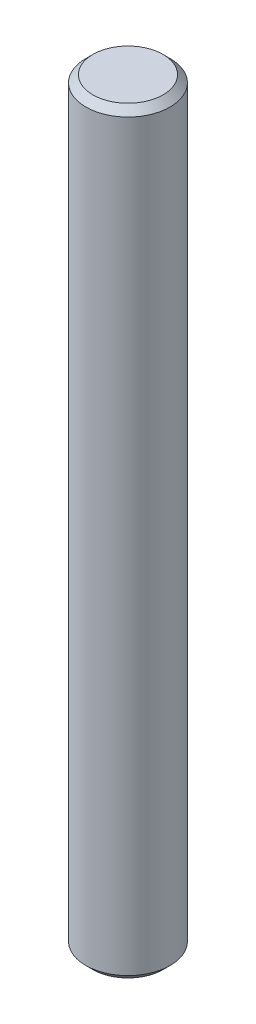
ISO-10303-21;
HEADER;
FILE_DESCRIPTION(('STEP AP214'),'2;1');
FILE_NAME('part.step','',(''),(''),'','','');
FILE_SCHEMA(('AUTOMOTIVE_DESIGN { 1 0 10303 214 1 1 1 1 }'));
ENDSEC;
DATA;
#1=APPLICATION_CONTEXT('core data for automotive mechanical design processes');
#2=APPLICATION_PROTOCOL_DEFINITION('international standard','automotive_design',2000,#1);
#3=PRODUCT_CONTEXT('',#1,'mechanical');
#4=PRODUCT('Part','Part','',(#3));
#5=PRODUCT_RELATED_PRODUCT_CATEGORY('part','',(#4));
#6=PRODUCT_DEFINITION_FORMATION('','',#4);
#7=PRODUCT_DEFINITION_CONTEXT('part definition',#1,'design');
#8=PRODUCT_DEFINITION('design','',#6,#7);
#9=PRODUCT_DEFINITION_SHAPE('','',#8);
#10=(LENGTH_UNIT() NAMED_UNIT(*) SI_UNIT(.MILLI.,.METRE.));
#11=(NAMED_UNIT(*) PLANE_ANGLE_UNIT() SI_UNIT($,.RADIAN.));
#12=(NAMED_UNIT(*) SI_UNIT($,.STERADIAN.) SOLID_ANGLE_UNIT());
#13=UNCERTAINTY_MEASURE_WITH_UNIT(LENGTH_MEASURE(1.E-05),#10,'distance_accuracy_value','');
#14=(GEOMETRIC_REPRESENTATION_CONTEXT(3) GLOBAL_UNCERTAINTY_ASSIGNED_CONTEXT((#13)) GLOBAL_UNIT_ASSIGNED_CONTEXT((#10,
#11,#12)) REPRESENTATION_CONTEXT('',''));
#15=CARTESIAN_POINT('',(0.,0.,0.));
#16=DIRECTION('',(0.,0.,1.));
#17=DIRECTION('',(1.,0.,0.));
#18=AXIS2_PLACEMENT_3D('',#15,#16,#17);
#19=CARTESIAN_POINT('',(0.,27.,0.));
#20=DIRECTION('',(0.,-1.,0.));
#21=DIRECTION('',(0.,0.,-1.));
#22=AXIS2_PLACEMENT_3D('',#19,#20,#21);
#23=CYLINDRICAL_SURFACE('',#22,3.);
#24=CARTESIAN_POINT('',(0.,-26.5,0.));
#25=DIRECTION('',(0.,1.,0.));
#26=DIRECTION('',(0.,0.,1.));
#27=AXIS2_PLACEMENT_3D('',#24,#25,#26);
#28=CIRCLE('',#27,3.);
#29=CARTESIAN_POINT('',(0.,-26.5,3.));
#30=VERTEX_POINT('',#29);
#31=EDGE_CURVE('E45',#30,#30,#28,.T.);
#32=ORIENTED_EDGE('',*,*,#31,.T.);
#33=EDGE_LOOP('',(#32));
#34=FACE_BOUND('',#33,.T.);
#35=CARTESIAN_POINT('',(0.,26.5,0.));
#36=DIRECTION('',(0.,1.,0.));
#37=DIRECTION('',(0.,0.,1.));
#38=AXIS2_PLACEMENT_3D('',#35,#36,#37);
#39=CIRCLE('',#38,3.);
#40=CARTESIAN_POINT('',(0.,26.5,3.));
#41=VERTEX_POINT('',#40);
#42=EDGE_CURVE('E49',#41,#41,#39,.F.);
#43=ORIENTED_EDGE('',*,*,#42,.T.);
#44=EDGE_LOOP('',(#43));
#45=FACE_BOUND('',#44,.T.);
#46=ADVANCED_FACE('F33',(#34,#45),#23,.T.);
#47=CARTESIAN_POINT('',(0.,27.,0.));
#48=DIRECTION('',(0.,1.,0.));
#49=DIRECTION('',(0.,0.,1.));
#50=AXIS2_PLACEMENT_3D('',#47,#48,#49);
#51=PLANE('',#50);
#52=CARTESIAN_POINT('',(0.,27.,0.));
#53=DIRECTION('',(0.,1.,0.));
#54=DIRECTION('',(0.,0.,1.));
#55=AXIS2_PLACEMENT_3D('',#52,#53,#54);
#56=CIRCLE('',#55,2.5);
#57=CARTESIAN_POINT('',(0.,27.,2.5));
#58=VERTEX_POINT('',#57);
#59=EDGE_CURVE('E10',#58,#58,#56,.T.);
#60=ORIENTED_EDGE('',*,*,#59,.T.);
#61=EDGE_LOOP('',(#60));
#62=FACE_BOUND('',#61,.T.);
#63=ADVANCED_FACE('F65',(#62),#51,.T.);
#64=CARTESIAN_POINT('',(0.,-27.,0.));
#65=DIRECTION('',(0.,1.,0.));
#66=DIRECTION('',(0.,0.,1.));
#67=AXIS2_PLACEMENT_3D('',#64,#65,#66);
#68=PLANE('',#67);
#69=CARTESIAN_POINT('',(0.,-27.,0.));
#70=DIRECTION('',(0.,1.,0.));
#71=DIRECTION('',(0.,0.,1.));
#72=AXIS2_PLACEMENT_3D('',#69,#70,#71);
#73=CIRCLE('',#72,2.5);
#74=CARTESIAN_POINT('',(0.,-27.,2.5));
#75=VERTEX_POINT('',#74);
#76=EDGE_CURVE('E41',#75,#75,#73,.F.);
#77=ORIENTED_EDGE('',*,*,#76,.T.);
#78=EDGE_LOOP('',(#77));
#79=FACE_BOUND('',#78,.T.);
#80=ADVANCED_FACE('F62',(#79),#68,.F.);
#81=CARTESIAN_POINT('',(0.,-26.5,0.));
#82=DIRECTION('',(0.,1.,0.));
#83=DIRECTION('',(0.,0.,1.));
#84=AXIS2_PLACEMENT_3D('',#81,#82,#83);
#85=CONICAL_SURFACE('',#84,3.,0.785398163397452);
#86=ORIENTED_EDGE('',*,*,#76,.F.);
#87=EDGE_LOOP('',(#86));
#88=FACE_BOUND('',#87,.T.);
#89=ORIENTED_EDGE('',*,*,#31,.F.);
#90=EDGE_LOOP('',(#89));
#91=FACE_BOUND('',#90,.T.);
#92=ADVANCED_FACE('F58',(#88,#91),#85,.T.);
#93=CARTESIAN_POINT('',(0.,27.,0.));
#94=DIRECTION('',(0.,-1.,0.));
#95=DIRECTION('',(0.,0.,-1.));
#96=AXIS2_PLACEMENT_3D('',#93,#94,#95);
#97=CONICAL_SURFACE('',#96,2.5,0.785398163397452);
#98=ORIENTED_EDGE('',*,*,#42,.F.);
#99=EDGE_LOOP('',(#98));
#100=FACE_BOUND('',#99,.T.);
#101=ORIENTED_EDGE('',*,*,#59,.F.);
#102=EDGE_LOOP('',(#101));
#103=FACE_BOUND('',#102,.T.);
#104=ADVANCED_FACE('F36',(#100,#103),#97,.T.);
#105=CLOSED_SHELL('',(#46,#63,#80,#92,#104));
#106=MANIFOLD_SOLID_BREP('B2',#105);
#107=ADVANCED_BREP_SHAPE_REPRESENTATION('',(#18,#106),#14);
#108=SHAPE_DEFINITION_REPRESENTATION(#9,#107);
ENDSEC;
END-ISO-10303-21;
